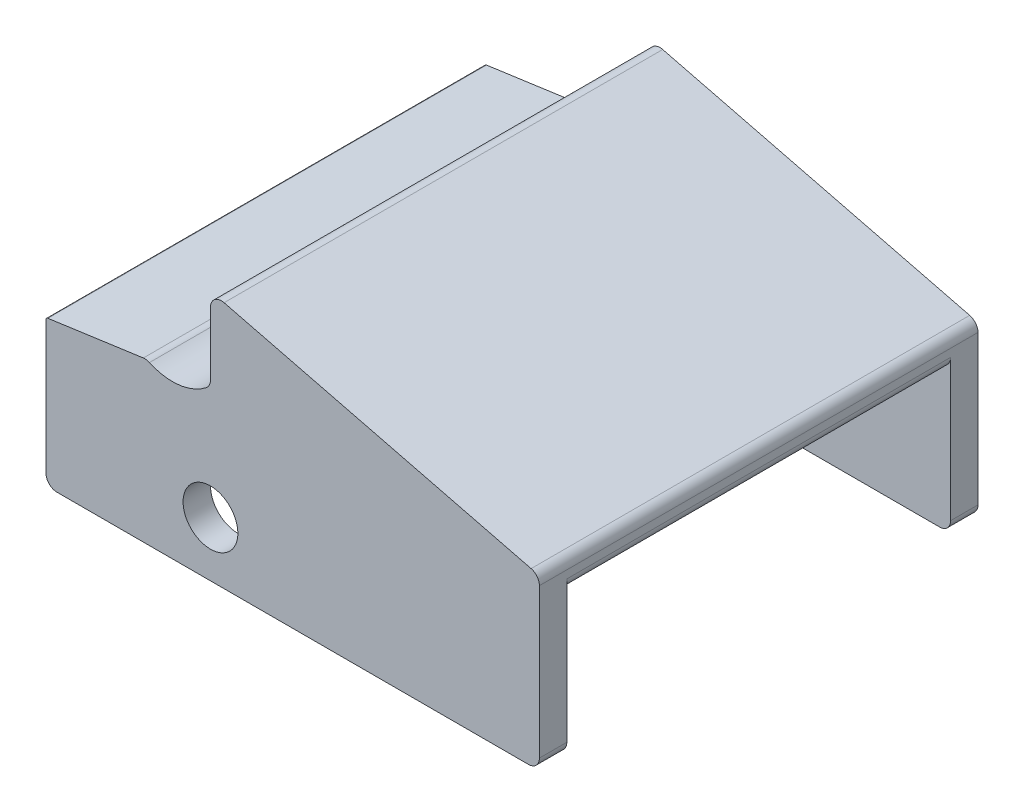
ISO-10303-21;
HEADER;
FILE_DESCRIPTION(('STEP AP214'),'2;1');
FILE_NAME('part.step','',(''),(''),'','','');
FILE_SCHEMA(('AUTOMOTIVE_DESIGN { 1 0 10303 214 1 1 1 1 }'));
ENDSEC;
DATA;
#1=APPLICATION_CONTEXT('core data for automotive mechanical design processes');
#2=APPLICATION_PROTOCOL_DEFINITION('international standard','automotive_design',2000,#1);
#3=PRODUCT_CONTEXT('',#1,'mechanical');
#4=PRODUCT('Part','Part','',(#3));
#5=PRODUCT_RELATED_PRODUCT_CATEGORY('part','',(#4));
#6=PRODUCT_DEFINITION_FORMATION('','',#4);
#7=PRODUCT_DEFINITION_CONTEXT('part definition',#1,'design');
#8=PRODUCT_DEFINITION('design','',#6,#7);
#9=PRODUCT_DEFINITION_SHAPE('','',#8);
#10=(LENGTH_UNIT() NAMED_UNIT(*) SI_UNIT(.MILLI.,.METRE.));
#11=(NAMED_UNIT(*) PLANE_ANGLE_UNIT() SI_UNIT($,.RADIAN.));
#12=(NAMED_UNIT(*) SI_UNIT($,.STERADIAN.) SOLID_ANGLE_UNIT());
#13=UNCERTAINTY_MEASURE_WITH_UNIT(LENGTH_MEASURE(1.E-05),#10,'distance_accuracy_value','');
#14=(GEOMETRIC_REPRESENTATION_CONTEXT(3) GLOBAL_UNCERTAINTY_ASSIGNED_CONTEXT((#13)) GLOBAL_UNIT_ASSIGNED_CONTEXT((#10,
#11,#12)) REPRESENTATION_CONTEXT('',''));
#15=CARTESIAN_POINT('',(0.,0.,0.));
#16=DIRECTION('',(0.,0.,1.));
#17=DIRECTION('',(1.,0.,0.));
#18=AXIS2_PLACEMENT_3D('',#15,#16,#17);
#19=CARTESIAN_POINT('',(0.,-8.1915,25.4));
#20=DIRECTION('',(0.,1.,0.));
#21=DIRECTION('',(0.,0.,1.));
#22=AXIS2_PLACEMENT_3D('',#19,#20,#21);
#23=PLANE('',#22);
#24=DIRECTION('',(1.,0.,0.));
#25=VECTOR('',#24,1.);
#26=CARTESIAN_POINT('',(0.,-8.1915,-22.225));
#27=LINE('',#26,#25);
#28=CARTESIAN_POINT('',(-27.305,-8.1915,-22.225));
#29=VERTEX_POINT('',#28);
#30=CARTESIAN_POINT('',(27.305,-8.1915,-22.225));
#31=VERTEX_POINT('',#30);
#32=EDGE_CURVE('E328',#29,#31,#27,.T.);
#33=ORIENTED_EDGE('',*,*,#32,.F.);
#34=DIRECTION('',(0.,0.,-1.));
#35=VECTOR('',#34,1.);
#36=CARTESIAN_POINT('',(-27.305,-8.1915,-25.4));
#37=LINE('',#36,#35);
#38=CARTESIAN_POINT('',(-27.305,-8.1915,-25.4));
#39=VERTEX_POINT('',#38);
#40=EDGE_CURVE('E250',#29,#39,#37,.T.);
#41=ORIENTED_EDGE('',*,*,#40,.T.);
#42=DIRECTION('',(1.,0.,0.));
#43=VECTOR('',#42,1.);
#44=CARTESIAN_POINT('',(0.,-8.1915,-25.4));
#45=LINE('',#44,#43);
#46=CARTESIAN_POINT('',(27.305,-8.1915,-25.4));
#47=VERTEX_POINT('',#46);
#48=EDGE_CURVE('E362',#39,#47,#45,.T.);
#49=ORIENTED_EDGE('',*,*,#48,.T.);
#50=DIRECTION('',(0.,0.,-1.));
#51=VECTOR('',#50,1.);
#52=CARTESIAN_POINT('',(27.305,-8.1915,25.4));
#53=LINE('',#52,#51);
#54=EDGE_CURVE('E248',#47,#31,#53,.F.);
#55=ORIENTED_EDGE('',*,*,#54,.T.);
#56=EDGE_LOOP('',(#33,#41,#49,#55));
#57=FACE_BOUND('',#56,.T.);
#58=ADVANCED_FACE('F35',(#57),#23,.F.);
#59=CARTESIAN_POINT('',(28.575,0.,25.4));
#60=DIRECTION('',(-1.,0.,0.));
#61=DIRECTION('',(0.,0.,1.));
#62=AXIS2_PLACEMENT_3D('',#59,#60,#61);
#63=PLANE('',#62);
#64=DIRECTION('',(0.,1.,0.));
#65=VECTOR('',#64,1.);
#66=CARTESIAN_POINT('',(28.575,0.,-22.225));
#67=LINE('',#66,#65);
#68=CARTESIAN_POINT('',(28.575,-6.9215,-22.225));
#69=VERTEX_POINT('',#68);
#70=CARTESIAN_POINT('',(28.575,9.4615,-22.225));
#71=VERTEX_POINT('',#70);
#72=EDGE_CURVE('E324',#69,#71,#67,.T.);
#73=ORIENTED_EDGE('',*,*,#72,.F.);
#74=DIRECTION('',(0.,0.,-1.));
#75=VECTOR('',#74,1.);
#76=CARTESIAN_POINT('',(28.575,-6.9215,25.4));
#77=LINE('',#76,#75);
#78=CARTESIAN_POINT('',(28.575,-6.9215,-25.4));
#79=VERTEX_POINT('',#78);
#80=EDGE_CURVE('E265',#69,#79,#77,.T.);
#81=ORIENTED_EDGE('',*,*,#80,.T.);
#82=DIRECTION('',(0.,1.,0.));
#83=VECTOR('',#82,1.);
#84=CARTESIAN_POINT('',(28.575,0.,-25.4));
#85=LINE('',#84,#83);
#86=CARTESIAN_POINT('',(28.575,10.3749139638664,-25.4));
#87=VERTEX_POINT('',#86);
#88=EDGE_CURVE('E365',#79,#87,#85,.T.);
#89=ORIENTED_EDGE('',*,*,#88,.T.);
#90=DIRECTION('',(0.,0.,-1.));
#91=VECTOR('',#90,1.);
#92=CARTESIAN_POINT('',(28.575,10.3749139638664,25.4));
#93=LINE('',#92,#91);
#94=CARTESIAN_POINT('',(28.575,10.3749139638664,25.4));
#95=VERTEX_POINT('',#94);
#96=EDGE_CURVE('E257',#87,#95,#93,.F.);
#97=ORIENTED_EDGE('',*,*,#96,.T.);
#98=DIRECTION('',(0.,1.,0.));
#99=VECTOR('',#98,1.);
#100=CARTESIAN_POINT('',(28.575,0.,25.4));
#101=LINE('',#100,#99);
#102=CARTESIAN_POINT('',(28.575,-6.9215,25.4));
#103=VERTEX_POINT('',#102);
#104=EDGE_CURVE('E347',#103,#95,#101,.T.);
#105=ORIENTED_EDGE('',*,*,#104,.F.);
#106=DIRECTION('',(0.,0.,-1.));
#107=VECTOR('',#106,1.);
#108=CARTESIAN_POINT('',(28.575,-6.9215,25.4));
#109=LINE('',#108,#107);
#110=CARTESIAN_POINT('',(28.575,-6.9215,22.225));
#111=VERTEX_POINT('',#110);
#112=EDGE_CURVE('E262',#103,#111,#109,.T.);
#113=ORIENTED_EDGE('',*,*,#112,.T.);
#114=DIRECTION('',(0.,1.,0.));
#115=VECTOR('',#114,1.);
#116=CARTESIAN_POINT('',(28.575,0.,22.225));
#117=LINE('',#116,#115);
#118=CARTESIAN_POINT('',(28.575,9.4615,22.225));
#119=VERTEX_POINT('',#118);
#120=EDGE_CURVE('E313',#111,#119,#117,.T.);
#121=ORIENTED_EDGE('',*,*,#120,.T.);
#122=DIRECTION('',(0.,0.,1.));
#123=VECTOR('',#122,1.);
#124=CARTESIAN_POINT('',(28.575,9.4615,-22.225));
#125=LINE('',#124,#123);
#126=EDGE_CURVE('E259',#119,#71,#125,.F.);
#127=ORIENTED_EDGE('',*,*,#126,.T.);
#128=EDGE_LOOP('',(#73,#81,#89,#97,#105,#113,#121,#127));
#129=FACE_BOUND('',#128,.T.);
#130=ADVANCED_FACE('F405',(#129),#63,.F.);
#131=CARTESIAN_POINT('',(-9.525,-1.8415,25.4));
#132=DIRECTION('',(0.,0.,-1.));
#133=DIRECTION('',(-1.,0.,0.));
#134=AXIS2_PLACEMENT_3D('',#131,#132,#133);
#135=CYLINDRICAL_SURFACE('',#134,3.175);
#136=CARTESIAN_POINT('',(-9.525,-1.8415,-25.4));
#137=DIRECTION('',(0.,0.,1.));
#138=DIRECTION('',(1.,0.,0.));
#139=AXIS2_PLACEMENT_3D('',#136,#137,#138);
#140=CIRCLE('',#139,3.175);
#141=CARTESIAN_POINT('',(-6.34999999999999,-1.8415,-25.4));
#142=VERTEX_POINT('',#141);
#143=EDGE_CURVE('E326',#142,#142,#140,.T.);
#144=ORIENTED_EDGE('',*,*,#143,.F.);
#145=EDGE_LOOP('',(#144));
#146=FACE_BOUND('',#145,.T.);
#147=CARTESIAN_POINT('',(-9.525,-1.8415,-22.225));
#148=DIRECTION('',(0.,0.,1.));
#149=DIRECTION('',(1.,0.,0.));
#150=AXIS2_PLACEMENT_3D('',#147,#148,#149);
#151=CIRCLE('',#150,3.175);
#152=CARTESIAN_POINT('',(-6.34999999999999,-1.8415,-22.225));
#153=VERTEX_POINT('',#152);
#154=EDGE_CURVE('E340',#153,#153,#151,.T.);
#155=ORIENTED_EDGE('',*,*,#154,.T.);
#156=EDGE_LOOP('',(#155));
#157=FACE_BOUND('',#156,.T.);
#158=ADVANCED_FACE('F457',(#146,#157),#135,.F.);
#159=CARTESIAN_POINT('',(-28.575,0.,25.4));
#160=DIRECTION('',(-1.,0.,0.));
#161=DIRECTION('',(0.,0.,1.));
#162=AXIS2_PLACEMENT_3D('',#159,#160,#161);
#163=PLANE('',#162);
#164=DIRECTION('',(0.,0.,1.));
#165=VECTOR('',#164,1.);
#166=CARTESIAN_POINT('',(-28.575,8.4455,25.4));
#167=LINE('',#166,#165);
#168=CARTESIAN_POINT('',(-28.575,8.4455,-22.225));
#169=VERTEX_POINT('',#168);
#170=CARTESIAN_POINT('',(-28.575,8.4455,22.225));
#171=VERTEX_POINT('',#170);
#172=EDGE_CURVE('E289',#169,#171,#167,.T.);
#173=ORIENTED_EDGE('',*,*,#172,.T.);
#174=DIRECTION('',(0.,1.,0.));
#175=VECTOR('',#174,1.);
#176=CARTESIAN_POINT('',(-28.575,0.,22.225));
#177=LINE('',#176,#175);
#178=CARTESIAN_POINT('',(-28.575,-6.9215,22.225));
#179=VERTEX_POINT('',#178);
#180=EDGE_CURVE('E305',#179,#171,#177,.T.);
#181=ORIENTED_EDGE('',*,*,#180,.F.);
#182=DIRECTION('',(0.,0.,-1.));
#183=VECTOR('',#182,1.);
#184=CARTESIAN_POINT('',(-28.575,-6.9215,25.4));
#185=LINE('',#184,#183);
#186=CARTESIAN_POINT('',(-28.575,-6.9215,25.4));
#187=VERTEX_POINT('',#186);
#188=EDGE_CURVE('E246',#179,#187,#185,.F.);
#189=ORIENTED_EDGE('',*,*,#188,.T.);
#190=DIRECTION('',(0.,1.,0.));
#191=VECTOR('',#190,1.);
#192=CARTESIAN_POINT('',(-28.575,0.,25.4));
#193=LINE('',#192,#191);
#194=CARTESIAN_POINT('',(-28.575,8.47858287899308,25.4));
#195=VERTEX_POINT('',#194);
#196=EDGE_CURVE('E205',#187,#195,#193,.T.);
#197=ORIENTED_EDGE('',*,*,#196,.T.);
#198=DIRECTION('',(0.,0.,-1.));
#199=VECTOR('',#198,1.);
#200=CARTESIAN_POINT('',(-28.575,8.47858287899308,25.4));
#201=LINE('',#200,#199);
#202=CARTESIAN_POINT('',(-28.575,8.47858287899308,-25.4));
#203=VERTEX_POINT('',#202);
#204=EDGE_CURVE('E286',#195,#203,#201,.T.);
#205=ORIENTED_EDGE('',*,*,#204,.T.);
#206=DIRECTION('',(0.,1.,0.));
#207=VECTOR('',#206,1.);
#208=CARTESIAN_POINT('',(-28.575,0.,-25.4));
#209=LINE('',#208,#207);
#210=CARTESIAN_POINT('',(-28.575,-6.9215,-25.4));
#211=VERTEX_POINT('',#210);
#212=EDGE_CURVE('E188',#211,#203,#209,.T.);
#213=ORIENTED_EDGE('',*,*,#212,.F.);
#214=DIRECTION('',(0.,0.,-1.));
#215=VECTOR('',#214,1.);
#216=CARTESIAN_POINT('',(-28.575,-6.9215,-22.225));
#217=LINE('',#216,#215);
#218=CARTESIAN_POINT('',(-28.575,-6.9215,-22.225));
#219=VERTEX_POINT('',#218);
#220=EDGE_CURVE('E244',#211,#219,#217,.F.);
#221=ORIENTED_EDGE('',*,*,#220,.T.);
#222=DIRECTION('',(0.,1.,0.));
#223=VECTOR('',#222,1.);
#224=CARTESIAN_POINT('',(-28.575,0.,-22.225));
#225=LINE('',#224,#223);
#226=EDGE_CURVE('E320',#219,#169,#225,.T.);
#227=ORIENTED_EDGE('',*,*,#226,.T.);
#228=EDGE_LOOP('',(#173,#181,#189,#197,#205,#213,#221,#227));
#229=FACE_BOUND('',#228,.T.);
#230=ADVANCED_FACE('F422',(#229),#163,.T.);
#231=DIRECTION('',(1.,0.,0.));
#232=VECTOR('',#231,1.);
#233=CARTESIAN_POINT('',(0.,-8.1915,25.4));
#234=LINE('',#233,#232);
#235=CARTESIAN_POINT('',(-27.305,-8.1915,25.4));
#236=VERTEX_POINT('',#235);
#237=CARTESIAN_POINT('',(27.305,-8.1915,25.4));
#238=VERTEX_POINT('',#237);
#239=EDGE_CURVE('E344',#236,#238,#234,.T.);
#240=ORIENTED_EDGE('',*,*,#239,.F.);
#241=DIRECTION('',(0.,0.,-1.));
#242=VECTOR('',#241,1.);
#243=CARTESIAN_POINT('',(-27.305,-8.1915,22.225));
#244=LINE('',#243,#242);
#245=CARTESIAN_POINT('',(-27.305,-8.1915,22.225));
#246=VERTEX_POINT('',#245);
#247=EDGE_CURVE('E237',#236,#246,#244,.T.);
#248=ORIENTED_EDGE('',*,*,#247,.T.);
#249=DIRECTION('',(1.,0.,0.));
#250=VECTOR('',#249,1.);
#251=CARTESIAN_POINT('',(0.,-8.1915,22.225));
#252=LINE('',#251,#250);
#253=CARTESIAN_POINT('',(27.305,-8.1915,22.225));
#254=VERTEX_POINT('',#253);
#255=EDGE_CURVE('E335',#246,#254,#252,.T.);
#256=ORIENTED_EDGE('',*,*,#255,.T.);
#257=DIRECTION('',(0.,0.,-1.));
#258=VECTOR('',#257,1.);
#259=CARTESIAN_POINT('',(27.305,-8.1915,25.4));
#260=LINE('',#259,#258);
#261=EDGE_CURVE('E235',#254,#238,#260,.F.);
#262=ORIENTED_EDGE('',*,*,#261,.T.);
#263=EDGE_LOOP('',(#240,#248,#256,#262));
#264=FACE_BOUND('',#263,.T.);
#265=ADVANCED_FACE('F434',(#264),#23,.F.);
#266=CARTESIAN_POINT('',(4.35535294117647,17.4214117647059,25.4));
#267=DIRECTION('',(-0.242535625036333,-0.970142500145332,0.));
#268=DIRECTION('',(0.970142500145332,-0.242535625036333,0.));
#269=AXIS2_PLACEMENT_3D('',#266,#267,#268);
#270=PLANE('',#269);
#271=DIRECTION('',(-0.970142500145332,0.242535625036333,0.));
#272=VECTOR('',#271,1.);
#273=CARTESIAN_POINT('',(4.35535294117647,17.4214117647059,25.4));
#274=LINE('',#273,#272);
#275=CARTESIAN_POINT('',(27.6130202437962,11.606994939051,25.4));
#276=VERTEX_POINT('',#275);
#277=CARTESIAN_POINT('',(-7.94697975620385,20.496994939051,25.4));
#278=VERTEX_POINT('',#277);
#279=EDGE_CURVE('E350',#276,#278,#274,.T.);
#280=ORIENTED_EDGE('',*,*,#279,.F.);
#281=DIRECTION('',(0.,0.,-1.));
#282=VECTOR('',#281,1.);
#283=CARTESIAN_POINT('',(27.6130202437962,11.606994939051,25.4));
#284=LINE('',#283,#282);
#285=CARTESIAN_POINT('',(27.6130202437962,11.606994939051,-25.4));
#286=VERTEX_POINT('',#285);
#287=EDGE_CURVE('E273',#276,#286,#284,.T.);
#288=ORIENTED_EDGE('',*,*,#287,.T.);
#289=DIRECTION('',(-0.970142500145332,0.242535625036333,0.));
#290=VECTOR('',#289,1.);
#291=CARTESIAN_POINT('',(4.35535294117647,17.4214117647059,-25.4));
#292=LINE('',#291,#290);
#293=CARTESIAN_POINT('',(-7.94697975620385,20.496994939051,-25.4));
#294=VERTEX_POINT('',#293);
#295=EDGE_CURVE('E368',#286,#294,#292,.T.);
#296=ORIENTED_EDGE('',*,*,#295,.T.);
#297=DIRECTION('',(0.,0.,-1.));
#298=VECTOR('',#297,1.);
#299=CARTESIAN_POINT('',(-7.94697975620385,20.496994939051,25.4));
#300=LINE('',#299,#298);
#301=EDGE_CURVE('E271',#294,#278,#300,.F.);
#302=ORIENTED_EDGE('',*,*,#301,.T.);
#303=EDGE_LOOP('',(#280,#288,#296,#302));
#304=FACE_BOUND('',#303,.T.);
#305=ADVANCED_FACE('F396',(#304),#270,.F.);
#306=CARTESIAN_POINT('',(-9.52499999999999,0.,25.4));
#307=DIRECTION('',(1.,0.,0.));
#308=DIRECTION('',(0.,0.,-1.));
#309=AXIS2_PLACEMENT_3D('',#306,#307,#308);
#310=PLANE('',#309);
#311=DIRECTION('',(0.,-1.,0.));
#312=VECTOR('',#311,1.);
#313=CARTESIAN_POINT('',(-9.52499999999999,0.,-25.4));
#314=LINE('',#313,#312);
#315=CARTESIAN_POINT('',(-9.52499999999999,19.2649139638664,-25.4));
#316=VERTEX_POINT('',#315);
#317=CARTESIAN_POINT('',(-9.52499999999999,11.9428033183221,-25.4));
#318=VERTEX_POINT('',#317);
#319=EDGE_CURVE('E371',#316,#318,#314,.T.);
#320=ORIENTED_EDGE('',*,*,#319,.T.);
#321=DIRECTION('',(0.,0.,1.));
#322=VECTOR('',#321,1.);
#323=CARTESIAN_POINT('',(-9.52499999999999,11.9428033183221,25.4));
#324=LINE('',#323,#322);
#325=CARTESIAN_POINT('',(-9.52499999999999,11.9428033183221,25.4));
#326=VERTEX_POINT('',#325);
#327=EDGE_CURVE('E233',#318,#326,#324,.T.);
#328=ORIENTED_EDGE('',*,*,#327,.T.);
#329=DIRECTION('',(0.,-1.,0.));
#330=VECTOR('',#329,1.);
#331=CARTESIAN_POINT('',(-9.52499999999999,0.,25.4));
#332=LINE('',#331,#330);
#333=CARTESIAN_POINT('',(-9.52499999999999,19.2649139638664,25.4));
#334=VERTEX_POINT('',#333);
#335=EDGE_CURVE('E353',#334,#326,#332,.T.);
#336=ORIENTED_EDGE('',*,*,#335,.F.);
#337=DIRECTION('',(0.,0.,-1.));
#338=VECTOR('',#337,1.);
#339=CARTESIAN_POINT('',(-9.52499999999999,19.2649139638664,25.4));
#340=LINE('',#339,#338);
#341=EDGE_CURVE('E230',#334,#316,#340,.T.);
#342=ORIENTED_EDGE('',*,*,#341,.T.);
#343=EDGE_LOOP('',(#320,#328,#336,#342));
#344=FACE_BOUND('',#343,.T.);
#345=ADVANCED_FACE('F382',(#344),#310,.F.);
#346=CARTESIAN_POINT('',(-13.9305461619915,15.9396458553781,25.4));
#347=DIRECTION('',(0.,0.,-1.));
#348=DIRECTION('',(-1.,0.,0.));
#349=AXIS2_PLACEMENT_3D('',#346,#347,#348);
#350=CYLINDRICAL_SURFACE('',#349,6.35);
#351=CARTESIAN_POINT('',(-13.9305461619915,15.9396458553781,-25.4));
#352=DIRECTION('',(0.,0.,1.));
#353=DIRECTION('',(1.,0.,0.));
#354=AXIS2_PLACEMENT_3D('',#351,#352,#353);
#355=CIRCLE('',#354,6.35);
#356=CARTESIAN_POINT('',(-10.0111134595021,10.9435926840581,-25.4));
#357=VERTEX_POINT('',#356);
#358=CARTESIAN_POINT('',(-16.5905836641057,10.1736506691725,-25.4));
#359=VERTEX_POINT('',#358);
#360=EDGE_CURVE('E189',#357,#359,#355,.F.);
#361=ORIENTED_EDGE('',*,*,#360,.T.);
#362=DIRECTION('',(0.,0.,-1.));
#363=VECTOR('',#362,1.);
#364=CARTESIAN_POINT('',(-16.5905836641057,10.1736506691725,25.4));
#365=LINE('',#364,#363);
#366=CARTESIAN_POINT('',(-16.5905836641057,10.1736506691725,25.4));
#367=VERTEX_POINT('',#366);
#368=EDGE_CURVE('E197',#359,#367,#365,.F.);
#369=ORIENTED_EDGE('',*,*,#368,.T.);
#370=CARTESIAN_POINT('',(-13.9305461619915,15.9396458553781,25.4));
#371=DIRECTION('',(0.,0.,1.));
#372=DIRECTION('',(1.,0.,0.));
#373=AXIS2_PLACEMENT_3D('',#370,#371,#372);
#374=CIRCLE('',#373,6.35);
#375=CARTESIAN_POINT('',(-10.0111134595021,10.9435926840581,25.4));
#376=VERTEX_POINT('',#375);
#377=EDGE_CURVE('E356',#376,#367,#374,.F.);
#378=ORIENTED_EDGE('',*,*,#377,.F.);
#379=DIRECTION('',(0.,0.,-1.));
#380=VECTOR('',#379,1.);
#381=CARTESIAN_POINT('',(-10.0111134595021,10.9435926840581,25.4));
#382=LINE('',#381,#380);
#383=EDGE_CURVE('E198',#376,#357,#382,.T.);
#384=ORIENTED_EDGE('',*,*,#383,.T.);
#385=EDGE_LOOP('',(#361,#369,#378,#384));
#386=FACE_BOUND('',#385,.T.);
#387=ADVANCED_FACE('F375',(#386),#350,.F.);
#388=CARTESIAN_POINT('',(-1.7438211063162,12.4558650451157,25.4));
#389=DIRECTION('',(-0.138647844534406,0.99034174667433,0.));
#390=DIRECTION('',(-0.99034174667433,-0.138647844534406,0.));
#391=AXIS2_PLACEMENT_3D('',#388,#389,#390);
#392=PLANE('',#391);
#393=DIRECTION('',(0.99034174667433,0.138647844534406,0.));
#394=VECTOR('',#393,1.);
#395=CARTESIAN_POINT('',(-1.7438211063162,12.4558650451157,-25.4));
#396=LINE('',#395,#394);
#397=CARTESIAN_POINT('',(-28.3562165525117,8.73012968264836,-25.4));
#398=VERTEX_POINT('',#397);
#399=CARTESIAN_POINT('',(-17.2986739270872,10.2781856502078,-25.4));
#400=VERTEX_POINT('',#399);
#401=EDGE_CURVE('E181',#398,#400,#396,.T.);
#402=ORIENTED_EDGE('',*,*,#401,.F.);
#403=DIRECTION('',(0.,0.,-1.));
#404=VECTOR('',#403,1.);
#405=CARTESIAN_POINT('',(-28.3562165525117,8.73012968264836,25.4));
#406=LINE('',#405,#404);
#407=CARTESIAN_POINT('',(-28.3562165525117,8.73012968264836,25.4));
#408=VERTEX_POINT('',#407);
#409=EDGE_CURVE('E50',#398,#408,#406,.F.);
#410=ORIENTED_EDGE('',*,*,#409,.T.);
#411=DIRECTION('',(0.99034174667433,0.138647844534406,0.));
#412=VECTOR('',#411,1.);
#413=CARTESIAN_POINT('',(-1.7438211063162,12.4558650451157,25.4));
#414=LINE('',#413,#412);
#415=CARTESIAN_POINT('',(-17.2986739270872,10.2781856502078,25.4));
#416=VERTEX_POINT('',#415);
#417=EDGE_CURVE('E202',#408,#416,#414,.T.);
#418=ORIENTED_EDGE('',*,*,#417,.T.);
#419=DIRECTION('',(0.,0.,1.));
#420=VECTOR('',#419,1.);
#421=CARTESIAN_POINT('',(-17.2986739270872,10.2781856502078,-25.4));
#422=LINE('',#421,#420);
#423=EDGE_CURVE('E196',#416,#400,#422,.F.);
#424=ORIENTED_EDGE('',*,*,#423,.T.);
#425=EDGE_LOOP('',(#402,#410,#418,#424));
#426=FACE_BOUND('',#425,.T.);
#427=ADVANCED_FACE('F201',(#426),#392,.T.);
#428=CARTESIAN_POINT('',(-9.525,-1.8415,22.225));
#429=DIRECTION('',(0.,0.,1.));
#430=DIRECTION('',(1.,0.,0.));
#431=AXIS2_PLACEMENT_3D('',#428,#429,#430);
#432=CIRCLE('',#431,3.175);
#433=CARTESIAN_POINT('',(-6.34999999999999,-1.8415,22.225));
#434=VERTEX_POINT('',#433);
#435=EDGE_CURVE('E332',#434,#434,#432,.T.);
#436=ORIENTED_EDGE('',*,*,#435,.F.);
#437=EDGE_LOOP('',(#436));
#438=FACE_BOUND('',#437,.T.);
#439=CARTESIAN_POINT('',(-9.525,-1.8415,25.4));
#440=DIRECTION('',(0.,0.,1.));
#441=DIRECTION('',(1.,0.,0.));
#442=AXIS2_PLACEMENT_3D('',#439,#440,#441);
#443=CIRCLE('',#442,3.175);
#444=CARTESIAN_POINT('',(-6.34999999999999,-1.8415,25.4));
#445=VERTEX_POINT('',#444);
#446=EDGE_CURVE('E341',#445,#445,#443,.T.);
#447=ORIENTED_EDGE('',*,*,#446,.T.);
#448=EDGE_LOOP('',(#447));
#449=FACE_BOUND('',#448,.T.);
#450=ADVANCED_FACE('F471',(#438,#449),#135,.F.);
#451=CARTESIAN_POINT('',(0.,0.,25.4));
#452=DIRECTION('',(0.,0.,1.));
#453=DIRECTION('',(1.,0.,0.));
#454=AXIS2_PLACEMENT_3D('',#451,#452,#453);
#455=PLANE('',#454);
#456=ORIENTED_EDGE('',*,*,#446,.F.);
#457=EDGE_LOOP('',(#456));
#458=FACE_BOUND('',#457,.T.);
#459=ORIENTED_EDGE('',*,*,#417,.F.);
#460=CARTESIAN_POINT('',(-28.321,8.47858287899308,25.4));
#461=DIRECTION('',(0.,0.,1.));
#462=DIRECTION('',(1.,0.,0.));
#463=AXIS2_PLACEMENT_3D('',#460,#461,#462);
#464=CIRCLE('',#463,0.254);
#465=EDGE_CURVE('E296',#408,#195,#464,.T.);
#466=ORIENTED_EDGE('',*,*,#465,.T.);
#467=ORIENTED_EDGE('',*,*,#196,.F.);
#468=CARTESIAN_POINT('',(-27.305,-6.9215,25.4));
#469=DIRECTION('',(0.,0.,1.));
#470=DIRECTION('',(1.,0.,0.));
#471=AXIS2_PLACEMENT_3D('',#468,#469,#470);
#472=CIRCLE('',#471,1.27);
#473=EDGE_CURVE('E226',#187,#236,#472,.T.);
#474=ORIENTED_EDGE('',*,*,#473,.T.);
#475=ORIENTED_EDGE('',*,*,#239,.T.);
#476=CARTESIAN_POINT('',(27.305,-6.9215,25.4));
#477=DIRECTION('',(0.,0.,1.));
#478=DIRECTION('',(1.,0.,0.));
#479=AXIS2_PLACEMENT_3D('',#476,#477,#478);
#480=CIRCLE('',#479,1.27);
#481=EDGE_CURVE('E224',#238,#103,#480,.T.);
#482=ORIENTED_EDGE('',*,*,#481,.T.);
#483=ORIENTED_EDGE('',*,*,#104,.T.);
#484=CARTESIAN_POINT('',(27.305,10.3749139638664,25.4));
#485=DIRECTION('',(0.,0.,1.));
#486=DIRECTION('',(1.,0.,0.));
#487=AXIS2_PLACEMENT_3D('',#484,#485,#486);
#488=CIRCLE('',#487,1.27);
#489=EDGE_CURVE('E222',#95,#276,#488,.T.);
#490=ORIENTED_EDGE('',*,*,#489,.T.);
#491=ORIENTED_EDGE('',*,*,#279,.T.);
#492=CARTESIAN_POINT('',(-8.25499999999999,19.2649139638664,25.4));
#493=DIRECTION('',(0.,0.,1.));
#494=DIRECTION('',(1.,0.,0.));
#495=AXIS2_PLACEMENT_3D('',#492,#493,#494);
#496=CIRCLE('',#495,1.27);
#497=EDGE_CURVE('E220',#278,#334,#496,.T.);
#498=ORIENTED_EDGE('',*,*,#497,.T.);
#499=ORIENTED_EDGE('',*,*,#335,.T.);
#500=CARTESIAN_POINT('',(-10.795,11.9428033183221,25.4));
#501=DIRECTION('',(0.,0.,1.));
#502=DIRECTION('',(1.,0.,0.));
#503=AXIS2_PLACEMENT_3D('',#500,#501,#502);
#504=CIRCLE('',#503,1.27);
#505=EDGE_CURVE('E278',#326,#376,#504,.F.);
#506=ORIENTED_EDGE('',*,*,#505,.T.);
#507=ORIENTED_EDGE('',*,*,#377,.T.);
#508=CARTESIAN_POINT('',(-17.1225911645285,9.0204516319314,25.4));
#509=DIRECTION('',(0.,0.,1.));
#510=DIRECTION('',(1.,0.,0.));
#511=AXIS2_PLACEMENT_3D('',#508,#509,#510);
#512=CIRCLE('',#511,1.27);
#513=EDGE_CURVE('E228',#367,#416,#512,.T.);
#514=ORIENTED_EDGE('',*,*,#513,.T.);
#515=EDGE_LOOP('',(#459,#466,#467,#474,#475,#482,#483,#490,#491,#498,#499,#506,#507,#514));
#516=FACE_BOUND('',#515,.T.);
#517=ADVANCED_FACE('F388',(#458,#516),#455,.T.);
#518=CARTESIAN_POINT('',(0.,0.,-25.4));
#519=DIRECTION('',(0.,0.,1.));
#520=DIRECTION('',(1.,0.,0.));
#521=AXIS2_PLACEMENT_3D('',#518,#519,#520);
#522=PLANE('',#521);
#523=ORIENTED_EDGE('',*,*,#143,.T.);
#524=EDGE_LOOP('',(#523));
#525=FACE_BOUND('',#524,.T.);
#526=ORIENTED_EDGE('',*,*,#212,.T.);
#527=CARTESIAN_POINT('',(-28.321,8.47858287899308,-25.4));
#528=DIRECTION('',(0.,0.,1.));
#529=DIRECTION('',(1.,0.,0.));
#530=AXIS2_PLACEMENT_3D('',#527,#528,#529);
#531=CIRCLE('',#530,0.254);
#532=EDGE_CURVE('E58',#203,#398,#531,.F.);
#533=ORIENTED_EDGE('',*,*,#532,.T.);
#534=ORIENTED_EDGE('',*,*,#401,.T.);
#535=CARTESIAN_POINT('',(-17.1225911645285,9.0204516319314,-25.4));
#536=DIRECTION('',(0.,0.,1.));
#537=DIRECTION('',(1.,0.,0.));
#538=AXIS2_PLACEMENT_3D('',#535,#536,#537);
#539=CIRCLE('',#538,1.27);
#540=EDGE_CURVE('E185',#400,#359,#539,.F.);
#541=ORIENTED_EDGE('',*,*,#540,.T.);
#542=ORIENTED_EDGE('',*,*,#360,.F.);
#543=CARTESIAN_POINT('',(-10.795,11.9428033183221,-25.4));
#544=DIRECTION('',(0.,0.,1.));
#545=DIRECTION('',(1.,0.,0.));
#546=AXIS2_PLACEMENT_3D('',#543,#544,#545);
#547=CIRCLE('',#546,1.27);
#548=EDGE_CURVE('E276',#357,#318,#547,.T.);
#549=ORIENTED_EDGE('',*,*,#548,.T.);
#550=ORIENTED_EDGE('',*,*,#319,.F.);
#551=CARTESIAN_POINT('',(-8.25499999999999,19.2649139638664,-25.4));
#552=DIRECTION('',(0.,0.,1.));
#553=DIRECTION('',(1.,0.,0.));
#554=AXIS2_PLACEMENT_3D('',#551,#552,#553);
#555=CIRCLE('',#554,1.27);
#556=EDGE_CURVE('E204',#316,#294,#555,.F.);
#557=ORIENTED_EDGE('',*,*,#556,.T.);
#558=ORIENTED_EDGE('',*,*,#295,.F.);
#559=CARTESIAN_POINT('',(27.305,10.3749139638664,-25.4));
#560=DIRECTION('',(0.,0.,1.));
#561=DIRECTION('',(1.,0.,0.));
#562=AXIS2_PLACEMENT_3D('',#559,#560,#561);
#563=CIRCLE('',#562,1.27);
#564=EDGE_CURVE('E207',#286,#87,#563,.F.);
#565=ORIENTED_EDGE('',*,*,#564,.T.);
#566=ORIENTED_EDGE('',*,*,#88,.F.);
#567=CARTESIAN_POINT('',(27.305,-6.9215,-25.4));
#568=DIRECTION('',(0.,0.,1.));
#569=DIRECTION('',(1.,0.,0.));
#570=AXIS2_PLACEMENT_3D('',#567,#568,#569);
#571=CIRCLE('',#570,1.27);
#572=EDGE_CURVE('E214',#79,#47,#571,.F.);
#573=ORIENTED_EDGE('',*,*,#572,.T.);
#574=ORIENTED_EDGE('',*,*,#48,.F.);
#575=CARTESIAN_POINT('',(-27.305,-6.9215,-25.4));
#576=DIRECTION('',(0.,0.,1.));
#577=DIRECTION('',(1.,0.,0.));
#578=AXIS2_PLACEMENT_3D('',#575,#576,#577);
#579=CIRCLE('',#578,1.27);
#580=EDGE_CURVE('E199',#39,#211,#579,.F.);
#581=ORIENTED_EDGE('',*,*,#580,.T.);
#582=EDGE_LOOP('',(#526,#533,#534,#541,#542,#549,#550,#557,#558,#565,#566,#573,#574,#581));
#583=FACE_BOUND('',#582,.T.);
#584=ADVANCED_FACE('F183',(#525,#583),#522,.F.);
#585=CARTESIAN_POINT('',(0.,8.1915,-22.225));
#586=DIRECTION('',(0.,-1.,0.));
#587=DIRECTION('',(0.,0.,-1.));
#588=AXIS2_PLACEMENT_3D('',#585,#586,#587);
#589=PLANE('',#588);
#590=DIRECTION('',(1.,0.,0.));
#591=VECTOR('',#590,1.);
#592=CARTESIAN_POINT('',(0.,8.1915,22.225));
#593=LINE('',#592,#591);
#594=CARTESIAN_POINT('',(-28.321,8.1915,22.225));
#595=VERTEX_POINT('',#594);
#596=CARTESIAN_POINT('',(27.305,8.1915,22.225));
#597=VERTEX_POINT('',#596);
#598=EDGE_CURVE('E302',#595,#597,#593,.T.);
#599=ORIENTED_EDGE('',*,*,#598,.F.);
#600=DIRECTION('',(0.,0.,1.));
#601=VECTOR('',#600,1.);
#602=CARTESIAN_POINT('',(-28.321,8.1915,-22.225));
#603=LINE('',#602,#601);
#604=CARTESIAN_POINT('',(-28.321,8.1915,-22.225));
#605=VERTEX_POINT('',#604);
#606=EDGE_CURVE('E292',#595,#605,#603,.F.);
#607=ORIENTED_EDGE('',*,*,#606,.T.);
#608=DIRECTION('',(1.,0.,0.));
#609=VECTOR('',#608,1.);
#610=CARTESIAN_POINT('',(0.,8.1915,-22.225));
#611=LINE('',#610,#609);
#612=CARTESIAN_POINT('',(27.305,8.1915,-22.225));
#613=VERTEX_POINT('',#612);
#614=EDGE_CURVE('E322',#605,#613,#611,.T.);
#615=ORIENTED_EDGE('',*,*,#614,.T.);
#616=DIRECTION('',(0.,0.,1.));
#617=VECTOR('',#616,1.);
#618=CARTESIAN_POINT('',(27.305,8.1915,22.225));
#619=LINE('',#618,#617);
#620=EDGE_CURVE('E268',#613,#597,#619,.T.);
#621=ORIENTED_EDGE('',*,*,#620,.T.);
#622=EDGE_LOOP('',(#599,#607,#615,#621));
#623=FACE_BOUND('',#622,.T.);
#624=ADVANCED_FACE('F310',(#623),#589,.T.);
#625=CARTESIAN_POINT('',(0.,0.,-22.225));
#626=DIRECTION('',(0.,0.,1.));
#627=DIRECTION('',(1.,0.,0.));
#628=AXIS2_PLACEMENT_3D('',#625,#626,#627);
#629=PLANE('',#628);
#630=ORIENTED_EDGE('',*,*,#154,.F.);
#631=EDGE_LOOP('',(#630));
#632=FACE_BOUND('',#631,.T.);
#633=ORIENTED_EDGE('',*,*,#226,.F.);
#634=CARTESIAN_POINT('',(-27.305,-6.9215,-22.225));
#635=DIRECTION('',(0.,0.,1.));
#636=DIRECTION('',(1.,0.,0.));
#637=AXIS2_PLACEMENT_3D('',#634,#635,#636);
#638=CIRCLE('',#637,1.27);
#639=EDGE_CURVE('E255',#219,#29,#638,.T.);
#640=ORIENTED_EDGE('',*,*,#639,.T.);
#641=ORIENTED_EDGE('',*,*,#32,.T.);
#642=CARTESIAN_POINT('',(27.305,-6.9215,-22.225));
#643=DIRECTION('',(0.,0.,1.));
#644=DIRECTION('',(1.,0.,0.));
#645=AXIS2_PLACEMENT_3D('',#642,#643,#644);
#646=CIRCLE('',#645,1.27);
#647=EDGE_CURVE('E253',#31,#69,#646,.T.);
#648=ORIENTED_EDGE('',*,*,#647,.T.);
#649=ORIENTED_EDGE('',*,*,#72,.T.);
#650=CARTESIAN_POINT('',(27.305,9.4615,-22.225));
#651=DIRECTION('',(0.,0.,1.));
#652=DIRECTION('',(1.,0.,0.));
#653=AXIS2_PLACEMENT_3D('',#650,#651,#652);
#654=CIRCLE('',#653,1.27);
#655=EDGE_CURVE('E283',#71,#613,#654,.F.);
#656=ORIENTED_EDGE('',*,*,#655,.T.);
#657=ORIENTED_EDGE('',*,*,#614,.F.);
#658=CARTESIAN_POINT('',(-28.321,8.4455,-22.225));
#659=DIRECTION('',(0.,0.,1.));
#660=DIRECTION('',(1.,0.,0.));
#661=AXIS2_PLACEMENT_3D('',#658,#659,#660);
#662=CIRCLE('',#661,0.254);
#663=EDGE_CURVE('E11',#605,#169,#662,.F.);
#664=ORIENTED_EDGE('',*,*,#663,.T.);
#665=EDGE_LOOP('',(#633,#640,#641,#648,#649,#656,#657,#664));
#666=FACE_BOUND('',#665,.T.);
#667=ADVANCED_FACE('F319',(#632,#666),#629,.T.);
#668=CARTESIAN_POINT('',(0.,0.,22.225));
#669=DIRECTION('',(0.,0.,1.));
#670=DIRECTION('',(1.,0.,0.));
#671=AXIS2_PLACEMENT_3D('',#668,#669,#670);
#672=PLANE('',#671);
#673=ORIENTED_EDGE('',*,*,#435,.T.);
#674=EDGE_LOOP('',(#673));
#675=FACE_BOUND('',#674,.T.);
#676=ORIENTED_EDGE('',*,*,#255,.F.);
#677=CARTESIAN_POINT('',(-27.305,-6.9215,22.225));
#678=DIRECTION('',(0.,0.,1.));
#679=DIRECTION('',(1.,0.,0.));
#680=AXIS2_PLACEMENT_3D('',#677,#678,#679);
#681=CIRCLE('',#680,1.27);
#682=EDGE_CURVE('E242',#246,#179,#681,.F.);
#683=ORIENTED_EDGE('',*,*,#682,.T.);
#684=ORIENTED_EDGE('',*,*,#180,.T.);
#685=CARTESIAN_POINT('',(-28.321,8.4455,22.225));
#686=DIRECTION('',(0.,0.,1.));
#687=DIRECTION('',(1.,0.,0.));
#688=AXIS2_PLACEMENT_3D('',#685,#686,#687);
#689=CIRCLE('',#688,0.254);
#690=EDGE_CURVE('E43',#171,#595,#689,.T.);
#691=ORIENTED_EDGE('',*,*,#690,.T.);
#692=ORIENTED_EDGE('',*,*,#598,.T.);
#693=CARTESIAN_POINT('',(27.305,9.4615,22.225));
#694=DIRECTION('',(0.,0.,1.));
#695=DIRECTION('',(1.,0.,0.));
#696=AXIS2_PLACEMENT_3D('',#693,#694,#695);
#697=CIRCLE('',#696,1.27);
#698=EDGE_CURVE('E280',#597,#119,#697,.T.);
#699=ORIENTED_EDGE('',*,*,#698,.T.);
#700=ORIENTED_EDGE('',*,*,#120,.F.);
#701=CARTESIAN_POINT('',(27.305,-6.9215,22.225));
#702=DIRECTION('',(0.,0.,1.));
#703=DIRECTION('',(1.,0.,0.));
#704=AXIS2_PLACEMENT_3D('',#701,#702,#703);
#705=CIRCLE('',#704,1.27);
#706=EDGE_CURVE('E240',#111,#254,#705,.F.);
#707=ORIENTED_EDGE('',*,*,#706,.T.);
#708=EDGE_LOOP('',(#676,#683,#684,#691,#692,#699,#700,#707));
#709=FACE_BOUND('',#708,.T.);
#710=ADVANCED_FACE('F301',(#675,#709),#672,.F.);
#711=CARTESIAN_POINT('',(-17.1225911645285,9.0204516319314,25.4));
#712=DIRECTION('',(0.,0.,-1.));
#713=DIRECTION('',(-1.,0.,0.));
#714=AXIS2_PLACEMENT_3D('',#711,#712,#713);
#715=CYLINDRICAL_SURFACE('',#714,1.27);
#716=ORIENTED_EDGE('',*,*,#513,.F.);
#717=ORIENTED_EDGE('',*,*,#368,.F.);
#718=ORIENTED_EDGE('',*,*,#540,.F.);
#719=ORIENTED_EDGE('',*,*,#423,.F.);
#720=EDGE_LOOP('',(#716,#717,#718,#719));
#721=FACE_BOUND('',#720,.T.);
#722=ADVANCED_FACE('F195',(#721),#715,.T.);
#723=CARTESIAN_POINT('',(-10.795,11.9428033183221,25.4));
#724=DIRECTION('',(0.,0.,-1.));
#725=DIRECTION('',(-1.,0.,0.));
#726=AXIS2_PLACEMENT_3D('',#723,#724,#725);
#727=CYLINDRICAL_SURFACE('',#726,1.27);
#728=ORIENTED_EDGE('',*,*,#505,.F.);
#729=ORIENTED_EDGE('',*,*,#327,.F.);
#730=ORIENTED_EDGE('',*,*,#548,.F.);
#731=ORIENTED_EDGE('',*,*,#383,.F.);
#732=EDGE_LOOP('',(#728,#729,#730,#731));
#733=FACE_BOUND('',#732,.T.);
#734=ADVANCED_FACE('F386',(#733),#727,.F.);
#735=CARTESIAN_POINT('',(-27.305,-6.9215,25.4));
#736=DIRECTION('',(0.,0.,1.));
#737=DIRECTION('',(1.,0.,0.));
#738=AXIS2_PLACEMENT_3D('',#735,#736,#737);
#739=CYLINDRICAL_SURFACE('',#738,1.27);
#740=ORIENTED_EDGE('',*,*,#473,.F.);
#741=ORIENTED_EDGE('',*,*,#188,.F.);
#742=ORIENTED_EDGE('',*,*,#682,.F.);
#743=ORIENTED_EDGE('',*,*,#247,.F.);
#744=EDGE_LOOP('',(#740,#741,#742,#743));
#745=FACE_BOUND('',#744,.T.);
#746=ADVANCED_FACE('F432',(#745),#739,.T.);
#747=CARTESIAN_POINT('',(-27.305,-6.9215,25.4));
#748=DIRECTION('',(0.,0.,1.));
#749=DIRECTION('',(1.,0.,0.));
#750=AXIS2_PLACEMENT_3D('',#747,#748,#749);
#751=CYLINDRICAL_SURFACE('',#750,1.27);
#752=ORIENTED_EDGE('',*,*,#639,.F.);
#753=ORIENTED_EDGE('',*,*,#220,.F.);
#754=ORIENTED_EDGE('',*,*,#580,.F.);
#755=ORIENTED_EDGE('',*,*,#40,.F.);
#756=EDGE_LOOP('',(#752,#753,#754,#755));
#757=FACE_BOUND('',#756,.T.);
#758=ADVANCED_FACE('F418',(#757),#751,.T.);
#759=CARTESIAN_POINT('',(27.305,-6.9215,25.4));
#760=DIRECTION('',(0.,0.,-1.));
#761=DIRECTION('',(-1.,0.,0.));
#762=AXIS2_PLACEMENT_3D('',#759,#760,#761);
#763=CYLINDRICAL_SURFACE('',#762,1.27);
#764=ORIENTED_EDGE('',*,*,#647,.F.);
#765=ORIENTED_EDGE('',*,*,#54,.F.);
#766=ORIENTED_EDGE('',*,*,#572,.F.);
#767=ORIENTED_EDGE('',*,*,#80,.F.);
#768=EDGE_LOOP('',(#764,#765,#766,#767));
#769=FACE_BOUND('',#768,.T.);
#770=ADVANCED_FACE('F410',(#769),#763,.T.);
#771=CARTESIAN_POINT('',(27.305,-6.9215,25.4));
#772=DIRECTION('',(0.,0.,-1.));
#773=DIRECTION('',(-1.,0.,0.));
#774=AXIS2_PLACEMENT_3D('',#771,#772,#773);
#775=CYLINDRICAL_SURFACE('',#774,1.27);
#776=ORIENTED_EDGE('',*,*,#481,.F.);
#777=ORIENTED_EDGE('',*,*,#261,.F.);
#778=ORIENTED_EDGE('',*,*,#706,.F.);
#779=ORIENTED_EDGE('',*,*,#112,.F.);
#780=EDGE_LOOP('',(#776,#777,#778,#779));
#781=FACE_BOUND('',#780,.T.);
#782=ADVANCED_FACE('F440',(#781),#775,.T.);
#783=CARTESIAN_POINT('',(27.305,9.4615,-22.225));
#784=DIRECTION('',(0.,0.,-1.));
#785=DIRECTION('',(-1.,0.,0.));
#786=AXIS2_PLACEMENT_3D('',#783,#784,#785);
#787=CYLINDRICAL_SURFACE('',#786,1.27);
#788=ORIENTED_EDGE('',*,*,#655,.F.);
#789=ORIENTED_EDGE('',*,*,#126,.F.);
#790=ORIENTED_EDGE('',*,*,#698,.F.);
#791=ORIENTED_EDGE('',*,*,#620,.F.);
#792=EDGE_LOOP('',(#788,#789,#790,#791));
#793=FACE_BOUND('',#792,.T.);
#794=ADVANCED_FACE('F443',(#793),#787,.T.);
#795=CARTESIAN_POINT('',(27.305,10.3749139638664,25.4));
#796=DIRECTION('',(0.,0.,-1.));
#797=DIRECTION('',(-1.,0.,0.));
#798=AXIS2_PLACEMENT_3D('',#795,#796,#797);
#799=CYLINDRICAL_SURFACE('',#798,1.27);
#800=ORIENTED_EDGE('',*,*,#489,.F.);
#801=ORIENTED_EDGE('',*,*,#96,.F.);
#802=ORIENTED_EDGE('',*,*,#564,.F.);
#803=ORIENTED_EDGE('',*,*,#287,.F.);
#804=EDGE_LOOP('',(#800,#801,#802,#803));
#805=FACE_BOUND('',#804,.T.);
#806=ADVANCED_FACE('F400',(#805),#799,.T.);
#807=CARTESIAN_POINT('',(-8.25499999999999,19.2649139638664,25.4));
#808=DIRECTION('',(0.,0.,-1.));
#809=DIRECTION('',(-1.,0.,0.));
#810=AXIS2_PLACEMENT_3D('',#807,#808,#809);
#811=CYLINDRICAL_SURFACE('',#810,1.27);
#812=ORIENTED_EDGE('',*,*,#497,.F.);
#813=ORIENTED_EDGE('',*,*,#301,.F.);
#814=ORIENTED_EDGE('',*,*,#556,.F.);
#815=ORIENTED_EDGE('',*,*,#341,.F.);
#816=EDGE_LOOP('',(#812,#813,#814,#815));
#817=FACE_BOUND('',#816,.T.);
#818=ADVANCED_FACE('F391',(#817),#811,.T.);
#819=CARTESIAN_POINT('',(-28.321,8.4455,25.4));
#820=DIRECTION('',(0.,0.,1.));
#821=DIRECTION('',(1.,0.,0.));
#822=AXIS2_PLACEMENT_3D('',#819,#820,#821);
#823=CYLINDRICAL_SURFACE('',#822,0.254);
#824=ORIENTED_EDGE('',*,*,#663,.F.);
#825=ORIENTED_EDGE('',*,*,#606,.F.);
#826=ORIENTED_EDGE('',*,*,#690,.F.);
#827=ORIENTED_EDGE('',*,*,#172,.F.);
#828=EDGE_LOOP('',(#824,#825,#826,#827));
#829=FACE_BOUND('',#828,.T.);
#830=ADVANCED_FACE('F316',(#829),#823,.T.);
#831=CARTESIAN_POINT('',(-28.321,8.47858287899308,25.4));
#832=DIRECTION('',(0.,0.,-1.));
#833=DIRECTION('',(-1.,0.,0.));
#834=AXIS2_PLACEMENT_3D('',#831,#832,#833);
#835=CYLINDRICAL_SURFACE('',#834,0.254);
#836=ORIENTED_EDGE('',*,*,#465,.F.);
#837=ORIENTED_EDGE('',*,*,#409,.F.);
#838=ORIENTED_EDGE('',*,*,#532,.F.);
#839=ORIENTED_EDGE('',*,*,#204,.F.);
#840=EDGE_LOOP('',(#836,#837,#838,#839));
#841=FACE_BOUND('',#840,.T.);
#842=ADVANCED_FACE('F37',(#841),#835,.T.);
#843=CLOSED_SHELL('',(#58,#130,#158,#230,#265,#305,#345,#387,#427,#450,#517,#584,#624,#667,#710,
#722,#734,#746,#758,#770,#782,#794,#806,#818,#830,#842));
#844=MANIFOLD_SOLID_BREP('B2',#843);
#845=ADVANCED_BREP_SHAPE_REPRESENTATION('',(#18,#844),#14);
#846=SHAPE_DEFINITION_REPRESENTATION(#9,#845);
ENDSEC;
END-ISO-10303-21;
